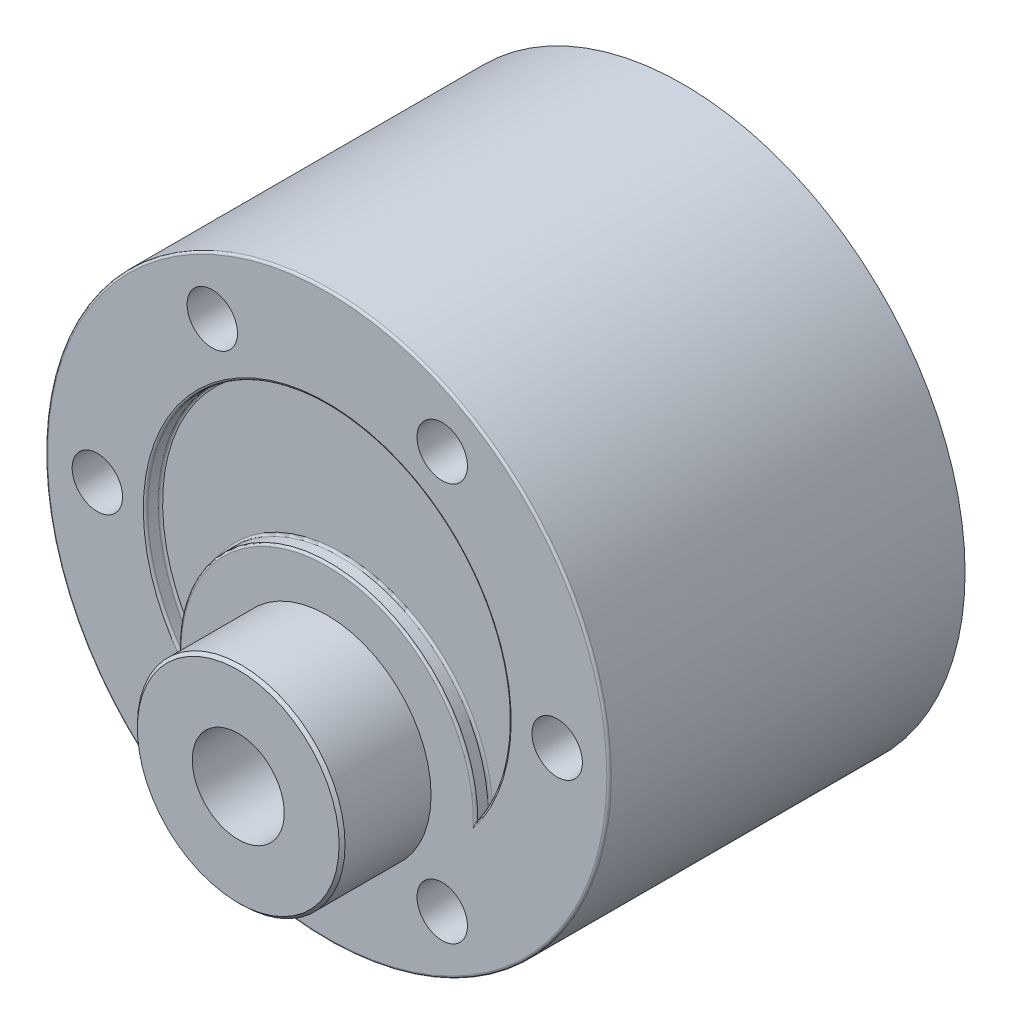
ISO-10303-21;
HEADER;
FILE_DESCRIPTION(('STEP AP214'),'2;1');
FILE_NAME('part.step','',(''),(''),'','','');
FILE_SCHEMA(('AUTOMOTIVE_DESIGN { 1 0 10303 214 1 1 1 1 }'));
ENDSEC;
DATA;
#1=APPLICATION_CONTEXT('core data for automotive mechanical design processes');
#2=APPLICATION_PROTOCOL_DEFINITION('international standard','automotive_design',2000,#1);
#3=PRODUCT_CONTEXT('',#1,'mechanical');
#4=PRODUCT('Part','Part','',(#3));
#5=PRODUCT_RELATED_PRODUCT_CATEGORY('part','',(#4));
#6=PRODUCT_DEFINITION_FORMATION('','',#4);
#7=PRODUCT_DEFINITION_CONTEXT('part definition',#1,'design');
#8=PRODUCT_DEFINITION('design','',#6,#7);
#9=PRODUCT_DEFINITION_SHAPE('','',#8);
#10=(LENGTH_UNIT() NAMED_UNIT(*) SI_UNIT(.MILLI.,.METRE.));
#11=(NAMED_UNIT(*) PLANE_ANGLE_UNIT() SI_UNIT($,.RADIAN.));
#12=(NAMED_UNIT(*) SI_UNIT($,.STERADIAN.) SOLID_ANGLE_UNIT());
#13=UNCERTAINTY_MEASURE_WITH_UNIT(LENGTH_MEASURE(1.E-05),#10,'distance_accuracy_value','');
#14=(GEOMETRIC_REPRESENTATION_CONTEXT(3) GLOBAL_UNCERTAINTY_ASSIGNED_CONTEXT((#13)) GLOBAL_UNIT_ASSIGNED_CONTEXT((#10,
#11,#12)) REPRESENTATION_CONTEXT('',''));
#15=CARTESIAN_POINT('',(0.,0.,0.));
#16=DIRECTION('',(0.,0.,1.));
#17=DIRECTION('',(1.,0.,0.));
#18=AXIS2_PLACEMENT_3D('',#15,#16,#17);
#19=CARTESIAN_POINT('',(0.,0.,23.));
#20=DIRECTION('',(0.,0.,1.));
#21=DIRECTION('',(1.,0.,0.));
#22=AXIS2_PLACEMENT_3D('',#19,#20,#21);
#23=CYLINDRICAL_SURFACE('',#22,12.25);
#24=DIRECTION('',(0.,0.,-1.));
#25=VECTOR('',#24,1.);
#26=CARTESIAN_POINT('',(-9.99971200956481,-7.07589285714286,23.5));
#27=LINE('',#26,#25);
#28=CARTESIAN_POINT('',(-9.99971200956481,-7.07589285714286,23.15));
#29=VERTEX_POINT('',#28);
#30=CARTESIAN_POINT('',(-9.99971200956481,-7.07589285714286,23.85));
#31=VERTEX_POINT('',#30);
#32=EDGE_CURVE('E146',#29,#31,#27,.F.);
#33=ORIENTED_EDGE('',*,*,#32,.F.);
#34=CARTESIAN_POINT('',(0.,0.,23.15));
#35=DIRECTION('',(0.,0.,1.));
#36=DIRECTION('',(1.,0.,0.));
#37=AXIS2_PLACEMENT_3D('',#34,#35,#36);
#38=CIRCLE('',#37,12.25);
#39=CARTESIAN_POINT('',(9.99971200956481,-7.07589285714286,23.15));
#40=VERTEX_POINT('',#39);
#41=EDGE_CURVE('E174',#29,#40,#38,.F.);
#42=ORIENTED_EDGE('',*,*,#41,.T.);
#43=DIRECTION('',(0.,0.,-1.));
#44=VECTOR('',#43,1.);
#45=CARTESIAN_POINT('',(9.99971200956481,-7.07589285714286,23.5));
#46=LINE('',#45,#44);
#47=CARTESIAN_POINT('',(9.99971200956481,-7.07589285714286,23.85));
#48=VERTEX_POINT('',#47);
#49=EDGE_CURVE('E149',#48,#40,#46,.T.);
#50=ORIENTED_EDGE('',*,*,#49,.F.);
#51=CARTESIAN_POINT('',(0.,0.,23.85));
#52=DIRECTION('',(0.,0.,1.));
#53=DIRECTION('',(1.,0.,0.));
#54=AXIS2_PLACEMENT_3D('',#51,#52,#53);
#55=CIRCLE('',#54,12.25);
#56=EDGE_CURVE('E172',#48,#31,#55,.T.);
#57=ORIENTED_EDGE('',*,*,#56,.T.);
#58=EDGE_LOOP('',(#33,#42,#50,#57));
#59=FACE_BOUND('',#58,.T.);
#60=ADVANCED_FACE('F32',(#59),#23,.F.);
#61=CARTESIAN_POINT('',(0.,0.,24.));
#62=DIRECTION('',(0.,0.,-1.));
#63=DIRECTION('',(-1.,0.,0.));
#64=AXIS2_PLACEMENT_3D('',#61,#62,#63);
#65=CYLINDRICAL_SURFACE('',#64,19.);
#66=CARTESIAN_POINT('',(0.,0.,23.85));
#67=DIRECTION('',(0.,0.,1.));
#68=DIRECTION('',(1.,0.,0.));
#69=AXIS2_PLACEMENT_3D('',#66,#67,#68);
#70=CIRCLE('',#69,19.);
#71=CARTESIAN_POINT('',(19.,0.,23.85));
#72=VERTEX_POINT('',#71);
#73=EDGE_CURVE('E176',#72,#72,#70,.F.);
#74=ORIENTED_EDGE('',*,*,#73,.T.);
#75=EDGE_LOOP('',(#74));
#76=FACE_BOUND('',#75,.T.);
#77=CARTESIAN_POINT('',(0.,0.,0.));
#78=DIRECTION('',(0.,0.,1.));
#79=DIRECTION('',(1.,0.,0.));
#80=AXIS2_PLACEMENT_3D('',#77,#78,#79);
#81=CIRCLE('',#80,19.);
#82=CARTESIAN_POINT('',(19.,0.,0.));
#83=VERTEX_POINT('',#82);
#84=EDGE_CURVE('E152',#83,#83,#81,.T.);
#85=ORIENTED_EDGE('',*,*,#84,.T.);
#86=EDGE_LOOP('',(#85));
#87=FACE_BOUND('',#86,.T.);
#88=ADVANCED_FACE('F230',(#76,#87),#65,.T.);
#89=CARTESIAN_POINT('',(0.,0.,24.));
#90=DIRECTION('',(0.,0.,1.));
#91=DIRECTION('',(1.,0.,0.));
#92=AXIS2_PLACEMENT_3D('',#89,#90,#91);
#93=PLANE('',#92);
#94=CARTESIAN_POINT('',(0.,0.,24.));
#95=DIRECTION('',(0.,0.,1.));
#96=DIRECTION('',(1.,0.,0.));
#97=AXIS2_PLACEMENT_3D('',#94,#95,#96);
#98=CIRCLE('',#97,12.4);
#99=CARTESIAN_POINT('',(-9.83448251799166,-7.55267857142858,24.));
#100=VERTEX_POINT('',#99);
#101=CARTESIAN_POINT('',(9.83448251799166,-7.55267857142858,24.));
#102=VERTEX_POINT('',#101);
#103=EDGE_CURVE('E46',#100,#102,#98,.F.);
#104=ORIENTED_EDGE('',*,*,#103,.T.);
#105=CARTESIAN_POINT('',(0.,-7.,24.));
#106=DIRECTION('',(0.,0.,1.));
#107=DIRECTION('',(1.,0.,0.));
#108=AXIS2_PLACEMENT_3D('',#105,#106,#107);
#109=CIRCLE('',#108,9.85);
#110=EDGE_CURVE('E170',#102,#100,#109,.T.);
#111=ORIENTED_EDGE('',*,*,#110,.T.);
#112=EDGE_LOOP('',(#104,#111));
#113=FACE_BOUND('',#112,.T.);
#114=CARTESIAN_POINT('',(0.,0.,24.));
#115=DIRECTION('',(0.,0.,1.));
#116=DIRECTION('',(1.,0.,0.));
#117=AXIS2_PLACEMENT_3D('',#114,#115,#116);
#118=CIRCLE('',#117,18.85);
#119=CARTESIAN_POINT('',(18.85,0.,24.));
#120=VERTEX_POINT('',#119);
#121=EDGE_CURVE('E166',#120,#120,#118,.T.);
#122=ORIENTED_EDGE('',*,*,#121,.T.);
#123=EDGE_LOOP('',(#122));
#124=FACE_BOUND('',#123,.T.);
#125=CARTESIAN_POINT('',(15.5,0.,24.));
#126=DIRECTION('',(0.,0.,1.));
#127=DIRECTION('',(1.,0.,0.));
#128=AXIS2_PLACEMENT_3D('',#125,#126,#127);
#129=CIRCLE('',#128,1.7);
#130=CARTESIAN_POINT('',(17.2,0.,24.));
#131=VERTEX_POINT('',#130);
#132=EDGE_CURVE('E102',#131,#131,#129,.T.);
#133=ORIENTED_EDGE('',*,*,#132,.F.);
#134=EDGE_LOOP('',(#133));
#135=FACE_BOUND('',#134,.T.);
#136=CARTESIAN_POINT('',(-15.5,0.,24.));
#137=DIRECTION('',(0.,0.,1.));
#138=DIRECTION('',(1.,0.,0.));
#139=AXIS2_PLACEMENT_3D('',#136,#137,#138);
#140=CIRCLE('',#139,1.7);
#141=CARTESIAN_POINT('',(-13.8,0.,24.));
#142=VERTEX_POINT('',#141);
#143=EDGE_CURVE('E101',#142,#142,#140,.T.);
#144=ORIENTED_EDGE('',*,*,#143,.F.);
#145=EDGE_LOOP('',(#144));
#146=FACE_BOUND('',#145,.T.);
#147=CARTESIAN_POINT('',(-7.75,13.4233937586588,24.));
#148=DIRECTION('',(0.,0.,1.));
#149=DIRECTION('',(1.,0.,0.));
#150=AXIS2_PLACEMENT_3D('',#147,#148,#149);
#151=CIRCLE('',#150,1.7);
#152=CARTESIAN_POINT('',(-6.05,13.4233937586588,24.));
#153=VERTEX_POINT('',#152);
#154=EDGE_CURVE('E113',#153,#153,#151,.T.);
#155=ORIENTED_EDGE('',*,*,#154,.F.);
#156=EDGE_LOOP('',(#155));
#157=FACE_BOUND('',#156,.T.);
#158=CARTESIAN_POINT('',(7.75,13.4233937586588,24.));
#159=DIRECTION('',(0.,0.,1.));
#160=DIRECTION('',(1.,0.,0.));
#161=AXIS2_PLACEMENT_3D('',#158,#159,#160);
#162=CIRCLE('',#161,1.7);
#163=CARTESIAN_POINT('',(9.45,13.4233937586588,24.));
#164=VERTEX_POINT('',#163);
#165=EDGE_CURVE('E119',#164,#164,#162,.T.);
#166=ORIENTED_EDGE('',*,*,#165,.F.);
#167=EDGE_LOOP('',(#166));
#168=FACE_BOUND('',#167,.T.);
#169=CARTESIAN_POINT('',(-7.75,-13.4233937586588,24.));
#170=DIRECTION('',(0.,0.,1.));
#171=DIRECTION('',(1.,0.,0.));
#172=AXIS2_PLACEMENT_3D('',#169,#170,#171);
#173=CIRCLE('',#172,1.7);
#174=CARTESIAN_POINT('',(-6.05,-13.4233937586588,24.));
#175=VERTEX_POINT('',#174);
#176=EDGE_CURVE('E125',#175,#175,#173,.T.);
#177=ORIENTED_EDGE('',*,*,#176,.F.);
#178=EDGE_LOOP('',(#177));
#179=FACE_BOUND('',#178,.T.);
#180=CARTESIAN_POINT('',(7.75,-13.4233937586588,24.));
#181=DIRECTION('',(0.,0.,1.));
#182=DIRECTION('',(1.,0.,0.));
#183=AXIS2_PLACEMENT_3D('',#180,#181,#182);
#184=CIRCLE('',#183,1.7);
#185=CARTESIAN_POINT('',(9.45,-13.4233937586588,24.));
#186=VERTEX_POINT('',#185);
#187=EDGE_CURVE('E131',#186,#186,#184,.T.);
#188=ORIENTED_EDGE('',*,*,#187,.F.);
#189=EDGE_LOOP('',(#188));
#190=FACE_BOUND('',#189,.T.);
#191=CARTESIAN_POINT('',(0.,-7.,24.));
#192=DIRECTION('',(0.,0.,1.));
#193=DIRECTION('',(1.,0.,0.));
#194=AXIS2_PLACEMENT_3D('',#191,#192,#193);
#195=CIRCLE('',#194,7.);
#196=CARTESIAN_POINT('',(7.,-7.,24.));
#197=VERTEX_POINT('',#196);
#198=EDGE_CURVE('E141',#197,#197,#195,.T.);
#199=ORIENTED_EDGE('',*,*,#198,.F.);
#200=EDGE_LOOP('',(#199));
#201=FACE_BOUND('',#200,.T.);
#202=ADVANCED_FACE('F236',(#113,#124,#135,#146,#157,#168,#179,#190,#201),#93,.T.);
#203=CARTESIAN_POINT('',(0.,0.,0.));
#204=DIRECTION('',(0.,0.,1.));
#205=DIRECTION('',(1.,0.,0.));
#206=AXIS2_PLACEMENT_3D('',#203,#204,#205);
#207=PLANE('',#206);
#208=ORIENTED_EDGE('',*,*,#84,.F.);
#209=EDGE_LOOP('',(#208));
#210=FACE_BOUND('',#209,.T.);
#211=ADVANCED_FACE('F245',(#210),#207,.F.);
#212=CARTESIAN_POINT('',(0.,0.,23.));
#213=DIRECTION('',(0.,0.,1.));
#214=DIRECTION('',(1.,0.,0.));
#215=AXIS2_PLACEMENT_3D('',#212,#213,#214);
#216=PLANE('',#215);
#217=CARTESIAN_POINT('',(0.,0.,23.));
#218=DIRECTION('',(0.,0.,1.));
#219=DIRECTION('',(1.,0.,0.));
#220=AXIS2_PLACEMENT_3D('',#217,#218,#219);
#221=CIRCLE('',#220,12.1);
#222=CARTESIAN_POINT('',(10.1420799108019,-6.59910714285714,23.));
#223=VERTEX_POINT('',#222);
#224=CARTESIAN_POINT('',(-10.1420799108019,-6.59910714285714,23.));
#225=VERTEX_POINT('',#224);
#226=EDGE_CURVE('E155',#223,#225,#221,.T.);
#227=ORIENTED_EDGE('',*,*,#226,.T.);
#228=CARTESIAN_POINT('',(0.,-7.,23.));
#229=DIRECTION('',(0.,0.,1.));
#230=DIRECTION('',(1.,0.,0.));
#231=AXIS2_PLACEMENT_3D('',#228,#229,#230);
#232=CIRCLE('',#231,10.15);
#233=EDGE_CURVE('E157',#225,#223,#232,.F.);
#234=ORIENTED_EDGE('',*,*,#233,.T.);
#235=EDGE_LOOP('',(#227,#234));
#236=FACE_BOUND('',#235,.T.);
#237=ADVANCED_FACE('F241',(#236),#216,.T.);
#238=CARTESIAN_POINT('',(0.,-7.,24.));
#239=DIRECTION('',(0.,0.,-1.));
#240=DIRECTION('',(-1.,0.,0.));
#241=AXIS2_PLACEMENT_3D('',#238,#239,#240);
#242=CYLINDRICAL_SURFACE('',#241,10.);
#243=ORIENTED_EDGE('',*,*,#49,.T.);
#244=CARTESIAN_POINT('',(0.,-7.,23.15));
#245=DIRECTION('',(0.,0.,1.));
#246=DIRECTION('',(1.,0.,0.));
#247=AXIS2_PLACEMENT_3D('',#244,#245,#246);
#248=CIRCLE('',#247,10.);
#249=EDGE_CURVE('E163',#40,#29,#248,.T.);
#250=ORIENTED_EDGE('',*,*,#249,.T.);
#251=ORIENTED_EDGE('',*,*,#32,.T.);
#252=CARTESIAN_POINT('',(0.,-7.,23.85));
#253=DIRECTION('',(0.,0.,1.));
#254=DIRECTION('',(1.,0.,0.));
#255=AXIS2_PLACEMENT_3D('',#252,#253,#254);
#256=CIRCLE('',#255,10.);
#257=EDGE_CURVE('E160',#31,#48,#256,.F.);
#258=ORIENTED_EDGE('',*,*,#257,.T.);
#259=EDGE_LOOP('',(#243,#250,#251,#258));
#260=FACE_BOUND('',#259,.T.);
#261=ADVANCED_FACE('F251',(#260),#242,.T.);
#262=CARTESIAN_POINT('',(0.,-7.,30.));
#263=DIRECTION('',(0.,0.,-1.));
#264=DIRECTION('',(-1.,0.,0.));
#265=AXIS2_PLACEMENT_3D('',#262,#263,#264);
#266=CYLINDRICAL_SURFACE('',#265,7.);
#267=CARTESIAN_POINT('',(0.,-7.,29.8));
#268=DIRECTION('',(0.,0.,1.));
#269=DIRECTION('',(1.,0.,0.));
#270=AXIS2_PLACEMENT_3D('',#267,#268,#269);
#271=CIRCLE('',#270,7.);
#272=CARTESIAN_POINT('',(7.,-7.,29.8));
#273=VERTEX_POINT('',#272);
#274=EDGE_CURVE('E11',#273,#273,#271,.F.);
#275=ORIENTED_EDGE('',*,*,#274,.T.);
#276=EDGE_LOOP('',(#275));
#277=FACE_BOUND('',#276,.T.);
#278=ORIENTED_EDGE('',*,*,#198,.T.);
#279=EDGE_LOOP('',(#278));
#280=FACE_BOUND('',#279,.T.);
#281=ADVANCED_FACE('F258',(#277,#280),#266,.T.);
#282=CARTESIAN_POINT('',(0.,-7.,30.));
#283=DIRECTION('',(0.,0.,1.));
#284=DIRECTION('',(1.,0.,0.));
#285=AXIS2_PLACEMENT_3D('',#282,#283,#284);
#286=PLANE('',#285);
#287=CARTESIAN_POINT('',(0.,-7.,30.));
#288=DIRECTION('',(0.,0.,1.));
#289=DIRECTION('',(1.,0.,0.));
#290=AXIS2_PLACEMENT_3D('',#287,#288,#289);
#291=CIRCLE('',#290,6.8);
#292=CARTESIAN_POINT('',(6.8,-7.,30.));
#293=VERTEX_POINT('',#292);
#294=EDGE_CURVE('E40',#293,#293,#291,.T.);
#295=ORIENTED_EDGE('',*,*,#294,.T.);
#296=EDGE_LOOP('',(#295));
#297=FACE_BOUND('',#296,.T.);
#298=CARTESIAN_POINT('',(0.,-7.,30.));
#299=DIRECTION('',(0.,0.,1.));
#300=DIRECTION('',(1.,0.,0.));
#301=AXIS2_PLACEMENT_3D('',#298,#299,#300);
#302=CIRCLE('',#301,3.1);
#303=CARTESIAN_POINT('',(3.1,-7.,30.));
#304=VERTEX_POINT('',#303);
#305=EDGE_CURVE('E137',#304,#304,#302,.T.);
#306=ORIENTED_EDGE('',*,*,#305,.F.);
#307=EDGE_LOOP('',(#306));
#308=FACE_BOUND('',#307,.T.);
#309=ADVANCED_FACE('F218',(#297,#308),#286,.T.);
#310=CARTESIAN_POINT('',(0.,-7.,10.));
#311=DIRECTION('',(0.,0.,1.));
#312=DIRECTION('',(1.,0.,0.));
#313=AXIS2_PLACEMENT_3D('',#310,#311,#312);
#314=CYLINDRICAL_SURFACE('',#313,3.1);
#315=CARTESIAN_POINT('',(0.,-7.,10.));
#316=DIRECTION('',(0.,0.,1.));
#317=DIRECTION('',(1.,0.,0.));
#318=AXIS2_PLACEMENT_3D('',#315,#316,#317);
#319=CIRCLE('',#318,3.1);
#320=CARTESIAN_POINT('',(3.1,-7.,10.));
#321=VERTEX_POINT('',#320);
#322=EDGE_CURVE('E138',#321,#321,#319,.T.);
#323=ORIENTED_EDGE('',*,*,#322,.F.);
#324=EDGE_LOOP('',(#323));
#325=FACE_BOUND('',#324,.T.);
#326=ORIENTED_EDGE('',*,*,#305,.T.);
#327=EDGE_LOOP('',(#326));
#328=FACE_BOUND('',#327,.T.);
#329=ADVANCED_FACE('F292',(#325,#328),#314,.F.);
#330=CARTESIAN_POINT('',(0.,-7.,10.));
#331=DIRECTION('',(0.,0.,1.));
#332=DIRECTION('',(1.,0.,0.));
#333=AXIS2_PLACEMENT_3D('',#330,#331,#332);
#334=PLANE('',#333);
#335=ORIENTED_EDGE('',*,*,#322,.T.);
#336=EDGE_LOOP('',(#335));
#337=FACE_BOUND('',#336,.T.);
#338=ADVANCED_FACE('F297',(#337),#334,.T.);
#339=CARTESIAN_POINT('',(7.75,-13.4233937586588,20.5));
#340=DIRECTION('',(0.,0.,1.));
#341=DIRECTION('',(1.,0.,0.));
#342=AXIS2_PLACEMENT_3D('',#339,#340,#341);
#343=CONICAL_SURFACE('',#342,1.7,1.02974425867665);
#344=CARTESIAN_POINT('',(7.75,-13.4233937586588,19.4785369476531));
#345=VERTEX_POINT('',#344);
#346=VERTEX_LOOP('',#345);
#347=FACE_BOUND('',#346,.T.);
#348=CARTESIAN_POINT('',(7.75,-13.4233937586588,20.5));
#349=DIRECTION('',(0.,0.,1.));
#350=DIRECTION('',(1.,0.,0.));
#351=AXIS2_PLACEMENT_3D('',#348,#349,#350);
#352=CIRCLE('',#351,1.7);
#353=CARTESIAN_POINT('',(9.45,-13.4233937586588,20.5));
#354=VERTEX_POINT('',#353);
#355=EDGE_CURVE('E134',#354,#354,#352,.T.);
#356=ORIENTED_EDGE('',*,*,#355,.T.);
#357=EDGE_LOOP('',(#356));
#358=FACE_BOUND('',#357,.T.);
#359=ADVANCED_FACE('F301',(#347,#358),#343,.F.);
#360=CARTESIAN_POINT('',(7.75,-13.4233937586588,24.));
#361=DIRECTION('',(0.,0.,1.));
#362=DIRECTION('',(1.,0.,0.));
#363=AXIS2_PLACEMENT_3D('',#360,#361,#362);
#364=CYLINDRICAL_SURFACE('',#363,1.7);
#365=ORIENTED_EDGE('',*,*,#355,.F.);
#366=EDGE_LOOP('',(#365));
#367=FACE_BOUND('',#366,.T.);
#368=ORIENTED_EDGE('',*,*,#187,.T.);
#369=EDGE_LOOP('',(#368));
#370=FACE_BOUND('',#369,.T.);
#371=ADVANCED_FACE('F305',(#367,#370),#364,.F.);
#372=CARTESIAN_POINT('',(-7.75,-13.4233937586588,20.5));
#373=DIRECTION('',(0.,0.,1.));
#374=DIRECTION('',(1.,0.,0.));
#375=AXIS2_PLACEMENT_3D('',#372,#373,#374);
#376=CONICAL_SURFACE('',#375,1.7,1.02974425867665);
#377=CARTESIAN_POINT('',(-7.75,-13.4233937586588,19.4785369476531));
#378=VERTEX_POINT('',#377);
#379=VERTEX_LOOP('',#378);
#380=FACE_BOUND('',#379,.T.);
#381=CARTESIAN_POINT('',(-7.75,-13.4233937586588,20.5));
#382=DIRECTION('',(0.,0.,1.));
#383=DIRECTION('',(1.,0.,0.));
#384=AXIS2_PLACEMENT_3D('',#381,#382,#383);
#385=CIRCLE('',#384,1.7);
#386=CARTESIAN_POINT('',(-6.05,-13.4233937586588,20.5));
#387=VERTEX_POINT('',#386);
#388=EDGE_CURVE('E128',#387,#387,#385,.T.);
#389=ORIENTED_EDGE('',*,*,#388,.T.);
#390=EDGE_LOOP('',(#389));
#391=FACE_BOUND('',#390,.T.);
#392=ADVANCED_FACE('F309',(#380,#391),#376,.F.);
#393=CARTESIAN_POINT('',(-7.75,-13.4233937586588,24.));
#394=DIRECTION('',(0.,0.,1.));
#395=DIRECTION('',(1.,0.,0.));
#396=AXIS2_PLACEMENT_3D('',#393,#394,#395);
#397=CYLINDRICAL_SURFACE('',#396,1.7);
#398=ORIENTED_EDGE('',*,*,#388,.F.);
#399=EDGE_LOOP('',(#398));
#400=FACE_BOUND('',#399,.T.);
#401=ORIENTED_EDGE('',*,*,#176,.T.);
#402=EDGE_LOOP('',(#401));
#403=FACE_BOUND('',#402,.T.);
#404=ADVANCED_FACE('F313',(#400,#403),#397,.F.);
#405=CARTESIAN_POINT('',(7.75,13.4233937586588,20.5));
#406=DIRECTION('',(0.,0.,1.));
#407=DIRECTION('',(1.,0.,0.));
#408=AXIS2_PLACEMENT_3D('',#405,#406,#407);
#409=CONICAL_SURFACE('',#408,1.7,1.02974425867665);
#410=CARTESIAN_POINT('',(7.75,13.4233937586588,19.4785369476531));
#411=VERTEX_POINT('',#410);
#412=VERTEX_LOOP('',#411);
#413=FACE_BOUND('',#412,.T.);
#414=CARTESIAN_POINT('',(7.75,13.4233937586588,20.5));
#415=DIRECTION('',(0.,0.,1.));
#416=DIRECTION('',(1.,0.,0.));
#417=AXIS2_PLACEMENT_3D('',#414,#415,#416);
#418=CIRCLE('',#417,1.7);
#419=CARTESIAN_POINT('',(9.45,13.4233937586588,20.5));
#420=VERTEX_POINT('',#419);
#421=EDGE_CURVE('E122',#420,#420,#418,.T.);
#422=ORIENTED_EDGE('',*,*,#421,.T.);
#423=EDGE_LOOP('',(#422));
#424=FACE_BOUND('',#423,.T.);
#425=ADVANCED_FACE('F317',(#413,#424),#409,.F.);
#426=CARTESIAN_POINT('',(7.75,13.4233937586588,24.));
#427=DIRECTION('',(0.,0.,1.));
#428=DIRECTION('',(1.,0.,0.));
#429=AXIS2_PLACEMENT_3D('',#426,#427,#428);
#430=CYLINDRICAL_SURFACE('',#429,1.7);
#431=ORIENTED_EDGE('',*,*,#421,.F.);
#432=EDGE_LOOP('',(#431));
#433=FACE_BOUND('',#432,.T.);
#434=ORIENTED_EDGE('',*,*,#165,.T.);
#435=EDGE_LOOP('',(#434));
#436=FACE_BOUND('',#435,.T.);
#437=ADVANCED_FACE('F321',(#433,#436),#430,.F.);
#438=CARTESIAN_POINT('',(-7.75,13.4233937586588,20.5));
#439=DIRECTION('',(0.,0.,1.));
#440=DIRECTION('',(1.,0.,0.));
#441=AXIS2_PLACEMENT_3D('',#438,#439,#440);
#442=CONICAL_SURFACE('',#441,1.7,1.02974425867665);
#443=CARTESIAN_POINT('',(-7.75,13.4233937586588,19.4785369476531));
#444=VERTEX_POINT('',#443);
#445=VERTEX_LOOP('',#444);
#446=FACE_BOUND('',#445,.T.);
#447=CARTESIAN_POINT('',(-7.75,13.4233937586588,20.5));
#448=DIRECTION('',(0.,0.,1.));
#449=DIRECTION('',(1.,0.,0.));
#450=AXIS2_PLACEMENT_3D('',#447,#448,#449);
#451=CIRCLE('',#450,1.7);
#452=CARTESIAN_POINT('',(-6.05,13.4233937586588,20.5));
#453=VERTEX_POINT('',#452);
#454=EDGE_CURVE('E116',#453,#453,#451,.T.);
#455=ORIENTED_EDGE('',*,*,#454,.T.);
#456=EDGE_LOOP('',(#455));
#457=FACE_BOUND('',#456,.T.);
#458=ADVANCED_FACE('F325',(#446,#457),#442,.F.);
#459=CARTESIAN_POINT('',(-7.75,13.4233937586588,24.));
#460=DIRECTION('',(0.,0.,1.));
#461=DIRECTION('',(1.,0.,0.));
#462=AXIS2_PLACEMENT_3D('',#459,#460,#461);
#463=CYLINDRICAL_SURFACE('',#462,1.7);
#464=ORIENTED_EDGE('',*,*,#454,.F.);
#465=EDGE_LOOP('',(#464));
#466=FACE_BOUND('',#465,.T.);
#467=ORIENTED_EDGE('',*,*,#154,.T.);
#468=EDGE_LOOP('',(#467));
#469=FACE_BOUND('',#468,.T.);
#470=ADVANCED_FACE('F329',(#466,#469),#463,.F.);
#471=CARTESIAN_POINT('',(-15.5,0.,20.5));
#472=DIRECTION('',(0.,0.,1.));
#473=DIRECTION('',(1.,0.,0.));
#474=AXIS2_PLACEMENT_3D('',#471,#472,#473);
#475=CONICAL_SURFACE('',#474,1.7,1.02974425867665);
#476=CARTESIAN_POINT('',(-15.5,0.,19.4785369476531));
#477=VERTEX_POINT('',#476);
#478=VERTEX_LOOP('',#477);
#479=FACE_BOUND('',#478,.T.);
#480=CARTESIAN_POINT('',(-15.5,0.,20.5));
#481=DIRECTION('',(0.,0.,1.));
#482=DIRECTION('',(1.,0.,0.));
#483=AXIS2_PLACEMENT_3D('',#480,#481,#482);
#484=CIRCLE('',#483,1.7);
#485=CARTESIAN_POINT('',(-13.8,0.,20.5));
#486=VERTEX_POINT('',#485);
#487=EDGE_CURVE('E105',#486,#486,#484,.T.);
#488=ORIENTED_EDGE('',*,*,#487,.T.);
#489=EDGE_LOOP('',(#488));
#490=FACE_BOUND('',#489,.T.);
#491=ADVANCED_FACE('F333',(#479,#490),#475,.F.);
#492=CARTESIAN_POINT('',(-15.5,0.,24.));
#493=DIRECTION('',(0.,0.,1.));
#494=DIRECTION('',(1.,0.,0.));
#495=AXIS2_PLACEMENT_3D('',#492,#493,#494);
#496=CYLINDRICAL_SURFACE('',#495,1.7);
#497=ORIENTED_EDGE('',*,*,#487,.F.);
#498=EDGE_LOOP('',(#497));
#499=FACE_BOUND('',#498,.T.);
#500=ORIENTED_EDGE('',*,*,#143,.T.);
#501=EDGE_LOOP('',(#500));
#502=FACE_BOUND('',#501,.T.);
#503=ADVANCED_FACE('F95',(#499,#502),#496,.F.);
#504=CARTESIAN_POINT('',(15.5,0.,20.5));
#505=DIRECTION('',(0.,0.,1.));
#506=DIRECTION('',(1.,0.,0.));
#507=AXIS2_PLACEMENT_3D('',#504,#505,#506);
#508=CONICAL_SURFACE('',#507,1.7,1.02974425867665);
#509=CARTESIAN_POINT('',(15.5,0.,19.4785369476531));
#510=VERTEX_POINT('',#509);
#511=VERTEX_LOOP('',#510);
#512=FACE_BOUND('',#511,.T.);
#513=CARTESIAN_POINT('',(15.5,0.,20.5));
#514=DIRECTION('',(0.,0.,1.));
#515=DIRECTION('',(1.,0.,0.));
#516=AXIS2_PLACEMENT_3D('',#513,#514,#515);
#517=CIRCLE('',#516,1.7);
#518=CARTESIAN_POINT('',(17.2,0.,20.5));
#519=VERTEX_POINT('',#518);
#520=EDGE_CURVE('E99',#519,#519,#517,.T.);
#521=ORIENTED_EDGE('',*,*,#520,.T.);
#522=EDGE_LOOP('',(#521));
#523=FACE_BOUND('',#522,.T.);
#524=ADVANCED_FACE('F91',(#512,#523),#508,.F.);
#525=CARTESIAN_POINT('',(15.5,0.,24.));
#526=DIRECTION('',(0.,0.,1.));
#527=DIRECTION('',(1.,0.,0.));
#528=AXIS2_PLACEMENT_3D('',#525,#526,#527);
#529=CYLINDRICAL_SURFACE('',#528,1.7);
#530=ORIENTED_EDGE('',*,*,#520,.F.);
#531=EDGE_LOOP('',(#530));
#532=FACE_BOUND('',#531,.T.);
#533=ORIENTED_EDGE('',*,*,#132,.T.);
#534=EDGE_LOOP('',(#533));
#535=FACE_BOUND('',#534,.T.);
#536=ADVANCED_FACE('F94',(#532,#535),#529,.F.);
#537=CARTESIAN_POINT('',(0.,0.,23.15));
#538=DIRECTION('',(0.,0.,1.));
#539=DIRECTION('',(1.,0.,0.));
#540=AXIS2_PLACEMENT_3D('',#537,#538,#539);
#541=TOROIDAL_SURFACE('',#540,12.1,0.15);
#542=CARTESIAN_POINT('',(9.99971200956481,-7.07589285714286,23.15));
#543=CARTESIAN_POINT('',(9.99970890912466,-7.07590236879212,23.1470158394005));
#544=CARTESIAN_POINT('',(9.99980306417597,-7.07561026655232,23.1440463349416));
#545=CARTESIAN_POINT('',(10.0001559074774,-7.07451494777811,23.138256800548));
#546=CARTESIAN_POINT('',(10.0004121365296,-7.07371937053659,23.1354352075502));
#547=CARTESIAN_POINT('',(10.0011414769435,-7.07145350323614,23.1292878583165));
#548=CARTESIAN_POINT('',(10.0016527146518,-7.06986450785411,23.1260115990033));
#549=CARTESIAN_POINT('',(10.0028278913949,-7.06620828160208,23.1197518945856));
#550=CARTESIAN_POINT('',(10.0034927631127,-7.06413812925027,23.1167704036029));
#551=CARTESIAN_POINT('',(10.0054643960917,-7.05799209125029,23.1089609783695));
#552=CARTESIAN_POINT('',(10.0068779329444,-7.05357838095351,23.1044301050922));
#553=CARTESIAN_POINT('',(10.0098710239738,-7.04421033017071,23.0960505188423));
#554=CARTESIAN_POINT('',(10.0114509151374,-7.03925489148904,23.0922032346769));
#555=CARTESIAN_POINT('',(10.0154959155637,-7.02653538226584,23.0832790735777));
#556=CARTESIAN_POINT('',(10.0180186027811,-7.01857514780722,23.078511296695));
#557=CARTESIAN_POINT('',(10.0231683854804,-7.00226035660985,23.0697605599404));
#558=CARTESIAN_POINT('',(10.0257957012068,-6.99390496027528,23.0657793735664));
#559=CARTESIAN_POINT('',(10.0337805548005,-6.96840651914411,23.0546806845101));
#560=CARTESIAN_POINT('',(10.03921744618,-6.95090515499966,23.0484529903597));
#561=CARTESIAN_POINT('',(10.0528741781186,-6.90656010331673,23.034756156218));
#562=CARTESIAN_POINT('',(10.0611178895474,-6.87944636827104,23.0282389236461));
#563=CARTESIAN_POINT('',(10.0775346741551,-6.82471580871011,23.0174710143641));
#564=CARTESIAN_POINT('',(10.085707575385,-6.79709809526841,23.0132248458067));
#565=CARTESIAN_POINT('',(10.1018813064872,-6.741677983778,23.0065602888576));
#566=CARTESIAN_POINT('',(10.1098825267645,-6.71387624822592,23.0041372010554));
#567=CARTESIAN_POINT('',(10.1256993503451,-6.65812902756485,23.0008872828142));
#568=CARTESIAN_POINT('',(10.1335149680339,-6.63018355380211,23.0000603282632));
#569=CARTESIAN_POINT('',(10.1415096356431,-6.60117786286166,23.0000010677507));
#570=CARTESIAN_POINT('',(10.1417948463968,-6.6001425187036,23.0000000072408));
#571=CARTESIAN_POINT('',(10.1420799108019,-6.59910714285714,23.));
#572=B_SPLINE_CURVE_WITH_KNOTS('',3,(#542,#543,#544,#545,#546,#547,#548,#549,#550,#551,#552,
#553,#554,#555,#556,#557,#558,#559,#560,#561,#562,#563,#564,#565,#566,#567,#568,#569,#570,#571),
.UNSPECIFIED.,.F.,.F.,(4,2,2,2,2,2,2,2,2,2,2,2,2,2,4),(0.,0.00891325126333926,
0.0176944008732258,0.0286629529122387,0.0396999287134201,0.0590347903319965,0.0784096012156179,
0.107184873151489,0.136024301320259,0.193969668118536,0.281069535089687,0.368341663050898,
0.455388048896114,0.542427665918452,0.545649394972062),.UNSPECIFIED.);
#573=EDGE_CURVE('E179',#40,#223,#572,.T.);
#574=ORIENTED_EDGE('',*,*,#573,.F.);
#575=ORIENTED_EDGE('',*,*,#41,.F.);
#576=CARTESIAN_POINT('',(-9.99971200956481,-7.07589285714286,23.15));
#577=CARTESIAN_POINT('',(-9.99970890912466,-7.07590236879212,23.1470158394005));
#578=CARTESIAN_POINT('',(-9.99980306417597,-7.07561026655232,23.1440463349416));
#579=CARTESIAN_POINT('',(-10.0001559074774,-7.07451494777811,23.138256800548));
#580=CARTESIAN_POINT('',(-10.0004121365296,-7.07371937053659,23.1354352075502));
#581=CARTESIAN_POINT('',(-10.0011414769435,-7.07145350323614,23.1292878583165));
#582=CARTESIAN_POINT('',(-10.0016527146518,-7.06986450785411,23.1260115990033));
#583=CARTESIAN_POINT('',(-10.0028278913949,-7.06620828160208,23.1197518945856));
#584=CARTESIAN_POINT('',(-10.0034927631127,-7.06413812925027,23.1167704036029));
#585=CARTESIAN_POINT('',(-10.0054643960917,-7.05799209125029,23.1089609783695));
#586=CARTESIAN_POINT('',(-10.0068779329444,-7.05357838095351,23.1044301050922));
#587=CARTESIAN_POINT('',(-10.0098710239738,-7.04421033017071,23.0960505188423));
#588=CARTESIAN_POINT('',(-10.0114509151374,-7.03925489148904,23.0922032346769));
#589=CARTESIAN_POINT('',(-10.0154959155637,-7.02653538226584,23.0832790735777));
#590=CARTESIAN_POINT('',(-10.0180186027811,-7.01857514780722,23.078511296695));
#591=CARTESIAN_POINT('',(-10.0231683854804,-7.00226035660985,23.0697605599404));
#592=CARTESIAN_POINT('',(-10.0257957012068,-6.99390496027528,23.0657793735664));
#593=CARTESIAN_POINT('',(-10.0337805548005,-6.96840651914411,23.0546806845101));
#594=CARTESIAN_POINT('',(-10.03921744618,-6.95090515499966,23.0484529903597));
#595=CARTESIAN_POINT('',(-10.0528741781186,-6.90656010331673,23.034756156218));
#596=CARTESIAN_POINT('',(-10.0611178895474,-6.87944636827104,23.0282389236461));
#597=CARTESIAN_POINT('',(-10.0775346741551,-6.82471580871011,23.0174710143641));
#598=CARTESIAN_POINT('',(-10.085707575385,-6.79709809526841,23.0132248458067));
#599=CARTESIAN_POINT('',(-10.1018813064872,-6.741677983778,23.0065602888576));
#600=CARTESIAN_POINT('',(-10.1098825267645,-6.71387624822592,23.0041372010554));
#601=CARTESIAN_POINT('',(-10.1256993503451,-6.65812902756485,23.0008872828142));
#602=CARTESIAN_POINT('',(-10.1335149680339,-6.63018355380211,23.0000603282632));
#603=CARTESIAN_POINT('',(-10.1415096356431,-6.60117786286166,23.0000010677507));
#604=CARTESIAN_POINT('',(-10.1417948463968,-6.6001425187036,23.0000000072408));
#605=CARTESIAN_POINT('',(-10.1420799108019,-6.59910714285714,23.));
#606=B_SPLINE_CURVE_WITH_KNOTS('',3,(#576,#577,#578,#579,#580,#581,#582,#583,#584,#585,#586,
#587,#588,#589,#590,#591,#592,#593,#594,#595,#596,#597,#598,#599,#600,#601,#602,#603,#604,#605),
.UNSPECIFIED.,.F.,.F.,(4,2,2,2,2,2,2,2,2,2,2,2,2,2,4),(0.,0.00891325126333926,
0.0176944008732258,0.0286629529122387,0.0396999287134201,0.0590347903319965,0.0784096012156179,
0.107184873151489,0.136024301320259,0.193969668118536,0.281069535089687,0.368341663050898,
0.455388048896114,0.542427665918452,0.545649394972062),.UNSPECIFIED.);
#607=EDGE_CURVE('E108',#225,#29,#606,.F.);
#608=ORIENTED_EDGE('',*,*,#607,.F.);
#609=ORIENTED_EDGE('',*,*,#226,.F.);
#610=EDGE_LOOP('',(#574,#575,#608,#609));
#611=FACE_BOUND('',#610,.T.);
#612=ADVANCED_FACE('F191',(#611),#541,.F.);
#613=CARTESIAN_POINT('',(0.,-7.,23.15));
#614=DIRECTION('',(0.,0.,1.));
#615=DIRECTION('',(1.,0.,0.));
#616=AXIS2_PLACEMENT_3D('',#613,#614,#615);
#617=TOROIDAL_SURFACE('',#616,10.15,0.15);
#618=ORIENTED_EDGE('',*,*,#607,.T.);
#619=ORIENTED_EDGE('',*,*,#249,.F.);
#620=ORIENTED_EDGE('',*,*,#573,.T.);
#621=ORIENTED_EDGE('',*,*,#233,.F.);
#622=EDGE_LOOP('',(#618,#619,#620,#621));
#623=FACE_BOUND('',#622,.T.);
#624=ADVANCED_FACE('F194',(#623),#617,.F.);
#625=CARTESIAN_POINT('',(0.,0.,23.85));
#626=DIRECTION('',(0.,0.,1.));
#627=DIRECTION('',(1.,0.,0.));
#628=AXIS2_PLACEMENT_3D('',#625,#626,#627);
#629=TOROIDAL_SURFACE('',#628,12.4,0.15);
#630=CARTESIAN_POINT('',(-9.99971200956481,-7.07589285714286,23.85));
#631=CARTESIAN_POINT('',(-9.9997150357946,-7.07588335412932,23.85298234124));
#632=CARTESIAN_POINT('',(-9.99962107043324,-7.07617510432418,23.8559500938354));
#633=CARTESIAN_POINT('',(-9.99926848382098,-7.07726916632481,23.8617364188775));
#634=CARTESIAN_POINT('',(-9.99901231686184,-7.07806386782897,23.8645565479615));
#635=CARTESIAN_POINT('',(-9.99828254500864,-7.08032652281359,23.8706986346197));
#636=CARTESIAN_POINT('',(-9.99777074193729,-7.08191265458518,23.8739713094544));
#637=CARTESIAN_POINT('',(-9.99659203956919,-7.08556197755204,23.8802240924695));
#638=CARTESIAN_POINT('',(-9.99592419606381,-7.08762807257331,23.8832022558146));
#639=CARTESIAN_POINT('',(-9.99394153348305,-7.09375472560754,23.8909940547403));
#640=CARTESIAN_POINT('',(-9.99251673238695,-7.09815023622429,23.8955121387823));
#641=CARTESIAN_POINT('',(-9.98948662267805,-7.10747623408767,23.9038673363885));
#642=CARTESIAN_POINT('',(-9.98788094802263,-7.11240780545378,23.9077030270055));
#643=CARTESIAN_POINT('',(-9.98375680617653,-7.12504316115562,23.9165863846342));
#644=CARTESIAN_POINT('',(-9.98117123481171,-7.13293797565109,23.9213277861283));
#645=CARTESIAN_POINT('',(-9.97585540659775,-7.14910699956167,23.930028967545));
#646=CARTESIAN_POINT('',(-9.97312484037417,-7.15738201469098,23.9339869833832));
#647=CARTESIAN_POINT('',(-9.96476527124352,-7.18261616798356,23.9450192931603));
#648=CARTESIAN_POINT('',(-9.95899233869909,-7.19991093946612,23.9512071087828));
#649=CARTESIAN_POINT('',(-9.94402947595449,-7.24437438309415,23.9650396072337));
#650=CARTESIAN_POINT('',(-9.93468887781167,-7.2717970604454,23.9716460701365));
#651=CARTESIAN_POINT('',(-9.91564401801475,-7.32701404139641,23.9825260989486));
#652=CARTESIAN_POINT('',(-9.9059390447702,-7.35480899583006,23.9867948159453));
#653=CARTESIAN_POINT('',(-9.88627070773454,-7.41044633204556,23.9934753385203));
#654=CARTESIAN_POINT('',(-9.87630803335782,-7.43828843192862,23.9958916565249));
#655=CARTESIAN_POINT('',(-9.85613823891527,-7.49397490101531,23.9991244310477));
#656=CARTESIAN_POINT('',(-9.84593113270943,-7.52181927000148,23.9999409780611));
#657=CARTESIAN_POINT('',(-9.83523949964424,-7.55063940152362,23.9999989646197));
#658=CARTESIAN_POINT('',(-9.83486107988631,-7.55165901714444,23.9999999929692));
#659=CARTESIAN_POINT('',(-9.83448251799166,-7.55267857142858,24.));
#660=B_SPLINE_CURVE_WITH_KNOTS('',3,(#630,#631,#632,#633,#634,#635,#636,#637,#638,#639,#640,
#641,#642,#643,#644,#645,#646,#647,#648,#649,#650,#651,#652,#653,#654,#655,#656,#657,#658,#659),
.UNSPECIFIED.,.F.,.F.,(4,2,2,2,2,2,2,2,2,2,2,2,2,2,4),(0.,0.00890793029732415,
0.0176841933441985,0.0286397748199013,0.0396634492578112,0.0589420403312653,0.0782603721734537,
0.106884815060953,0.135573000946572,0.1932147631672,0.282208817186217,0.371386768686931,
0.460346787128353,0.549301773171236,0.552564494676407),.UNSPECIFIED.);
#661=EDGE_CURVE('E54',#31,#100,#660,.T.);
#662=ORIENTED_EDGE('',*,*,#661,.F.);
#663=ORIENTED_EDGE('',*,*,#56,.F.);
#664=CARTESIAN_POINT('',(9.99971200956481,-7.07589285714286,23.85));
#665=CARTESIAN_POINT('',(9.9997150357946,-7.07588335412932,23.85298234124));
#666=CARTESIAN_POINT('',(9.99962107043324,-7.07617510432418,23.8559500938354));
#667=CARTESIAN_POINT('',(9.99926848382098,-7.07726916632481,23.8617364188775));
#668=CARTESIAN_POINT('',(9.99901231686184,-7.07806386782897,23.8645565479615));
#669=CARTESIAN_POINT('',(9.99828254500864,-7.08032652281359,23.8706986346197));
#670=CARTESIAN_POINT('',(9.99777074193729,-7.08191265458518,23.8739713094544));
#671=CARTESIAN_POINT('',(9.99659203956919,-7.08556197755204,23.8802240924695));
#672=CARTESIAN_POINT('',(9.99592419606381,-7.08762807257331,23.8832022558146));
#673=CARTESIAN_POINT('',(9.99394153348305,-7.09375472560754,23.8909940547403));
#674=CARTESIAN_POINT('',(9.99251673238695,-7.09815023622429,23.8955121387823));
#675=CARTESIAN_POINT('',(9.98948662267805,-7.10747623408767,23.9038673363885));
#676=CARTESIAN_POINT('',(9.98788094802263,-7.11240780545378,23.9077030270055));
#677=CARTESIAN_POINT('',(9.98375680617653,-7.12504316115562,23.9165863846342));
#678=CARTESIAN_POINT('',(9.98117123481171,-7.13293797565109,23.9213277861283));
#679=CARTESIAN_POINT('',(9.97585540659775,-7.14910699956167,23.930028967545));
#680=CARTESIAN_POINT('',(9.97312484037417,-7.15738201469098,23.9339869833832));
#681=CARTESIAN_POINT('',(9.96476527124352,-7.18261616798356,23.9450192931603));
#682=CARTESIAN_POINT('',(9.95899233869909,-7.19991093946612,23.9512071087828));
#683=CARTESIAN_POINT('',(9.94402947595449,-7.24437438309415,23.9650396072337));
#684=CARTESIAN_POINT('',(9.93468887781167,-7.2717970604454,23.9716460701365));
#685=CARTESIAN_POINT('',(9.91564401801475,-7.32701404139641,23.9825260989486));
#686=CARTESIAN_POINT('',(9.9059390447702,-7.35480899583006,23.9867948159453));
#687=CARTESIAN_POINT('',(9.88627070773454,-7.41044633204556,23.9934753385203));
#688=CARTESIAN_POINT('',(9.87630803335782,-7.43828843192862,23.9958916565249));
#689=CARTESIAN_POINT('',(9.85613823891527,-7.49397490101531,23.9991244310477));
#690=CARTESIAN_POINT('',(9.84593113270943,-7.52181927000148,23.9999409780611));
#691=CARTESIAN_POINT('',(9.83523949964424,-7.55063940152362,23.9999989646197));
#692=CARTESIAN_POINT('',(9.83486107988631,-7.55165901714444,23.9999999929692));
#693=CARTESIAN_POINT('',(9.83448251799166,-7.55267857142858,24.));
#694=B_SPLINE_CURVE_WITH_KNOTS('',3,(#664,#665,#666,#667,#668,#669,#670,#671,#672,#673,#674,
#675,#676,#677,#678,#679,#680,#681,#682,#683,#684,#685,#686,#687,#688,#689,#690,#691,#692,#693),
.UNSPECIFIED.,.F.,.F.,(4,2,2,2,2,2,2,2,2,2,2,2,2,2,4),(0.,0.00890793029732415,
0.0176841933441985,0.0286397748199013,0.0396634492578112,0.0589420403312653,0.0782603721734537,
0.106884815060953,0.135573000946572,0.1932147631672,0.282208817186217,0.371386768686931,
0.460346787128353,0.549301773171236,0.552564494676407),.UNSPECIFIED.);
#695=EDGE_CURVE('E186',#102,#48,#694,.F.);
#696=ORIENTED_EDGE('',*,*,#695,.F.);
#697=ORIENTED_EDGE('',*,*,#103,.F.);
#698=EDGE_LOOP('',(#662,#663,#696,#697));
#699=FACE_BOUND('',#698,.T.);
#700=ADVANCED_FACE('F198',(#699),#629,.T.);
#701=CARTESIAN_POINT('',(0.,-7.,23.85));
#702=DIRECTION('',(0.,0.,1.));
#703=DIRECTION('',(1.,0.,0.));
#704=AXIS2_PLACEMENT_3D('',#701,#702,#703);
#705=TOROIDAL_SURFACE('',#704,9.85,0.15);
#706=ORIENTED_EDGE('',*,*,#695,.T.);
#707=ORIENTED_EDGE('',*,*,#257,.F.);
#708=ORIENTED_EDGE('',*,*,#661,.T.);
#709=ORIENTED_EDGE('',*,*,#110,.F.);
#710=EDGE_LOOP('',(#706,#707,#708,#709));
#711=FACE_BOUND('',#710,.T.);
#712=ADVANCED_FACE('F204',(#711),#705,.T.);
#713=CARTESIAN_POINT('',(0.,0.,23.85));
#714=DIRECTION('',(0.,0.,1.));
#715=DIRECTION('',(1.,0.,0.));
#716=AXIS2_PLACEMENT_3D('',#713,#714,#715);
#717=TOROIDAL_SURFACE('',#716,18.85,0.15);
#718=ORIENTED_EDGE('',*,*,#73,.F.);
#719=EDGE_LOOP('',(#718));
#720=FACE_BOUND('',#719,.T.);
#721=ORIENTED_EDGE('',*,*,#121,.F.);
#722=EDGE_LOOP('',(#721));
#723=FACE_BOUND('',#722,.T.);
#724=ADVANCED_FACE('F222',(#720,#723),#717,.T.);
#725=CARTESIAN_POINT('',(0.,-7.,30.));
#726=DIRECTION('',(0.,0.,-1.));
#727=DIRECTION('',(-1.,0.,0.));
#728=AXIS2_PLACEMENT_3D('',#725,#726,#727);
#729=CONICAL_SURFACE('',#728,6.8,0.785398163397442);
#730=ORIENTED_EDGE('',*,*,#274,.F.);
#731=EDGE_LOOP('',(#730));
#732=FACE_BOUND('',#731,.T.);
#733=ORIENTED_EDGE('',*,*,#294,.F.);
#734=EDGE_LOOP('',(#733));
#735=FACE_BOUND('',#734,.T.);
#736=ADVANCED_FACE('F34',(#732,#735),#729,.T.);
#737=CLOSED_SHELL('',(#60,#88,#202,#211,#237,#261,#281,#309,#329,#338,#359,#371,#392,#404,#425,
#437,#458,#470,#491,#503,#524,#536,#612,#624,#700,#712,#724,#736));
#738=MANIFOLD_SOLID_BREP('B2',#737);
#739=ADVANCED_BREP_SHAPE_REPRESENTATION('',(#18,#738),#14);
#740=SHAPE_DEFINITION_REPRESENTATION(#9,#739);
ENDSEC;
END-ISO-10303-21;
